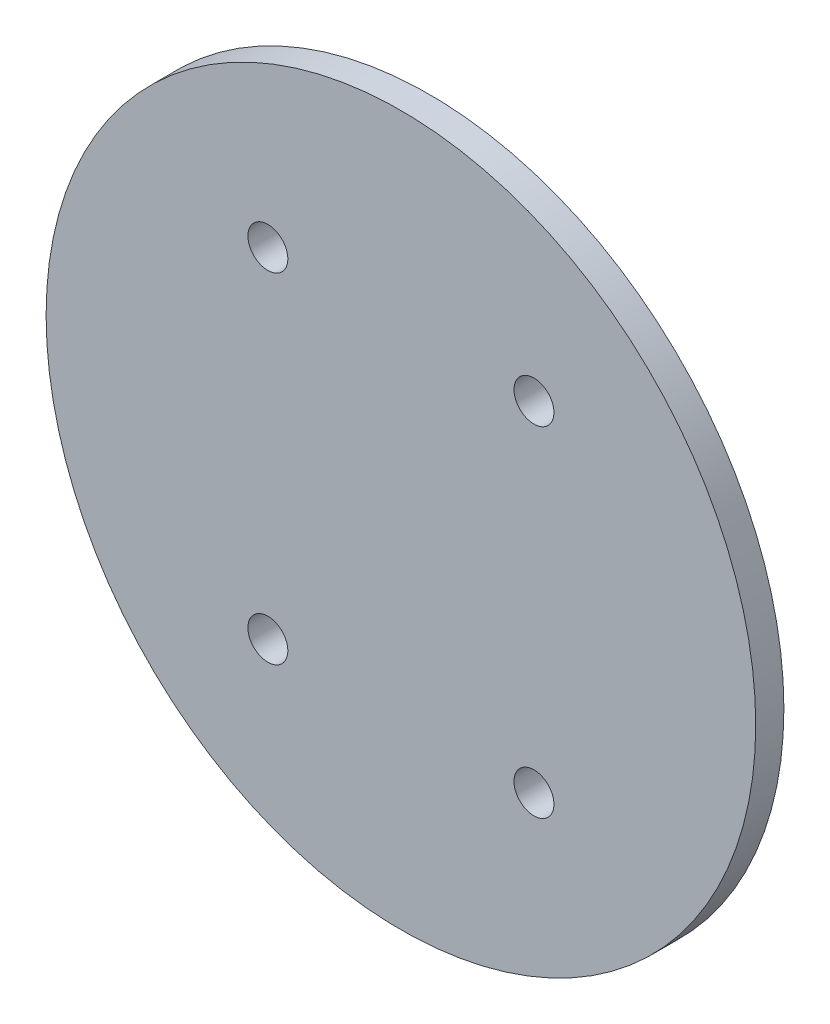
ISO-10303-21;
HEADER;
FILE_DESCRIPTION(('STEP AP214'),'2;1');
FILE_NAME('part.step','',(''),(''),'','','');
FILE_SCHEMA(('AUTOMOTIVE_DESIGN { 1 0 10303 214 1 1 1 1 }'));
ENDSEC;
DATA;
#1=APPLICATION_CONTEXT('core data for automotive mechanical design processes');
#2=APPLICATION_PROTOCOL_DEFINITION('international standard','automotive_design',2000,#1);
#3=PRODUCT_CONTEXT('',#1,'mechanical');
#4=PRODUCT('Part','Part','',(#3));
#5=PRODUCT_RELATED_PRODUCT_CATEGORY('part','',(#4));
#6=PRODUCT_DEFINITION_FORMATION('','',#4);
#7=PRODUCT_DEFINITION_CONTEXT('part definition',#1,'design');
#8=PRODUCT_DEFINITION('design','',#6,#7);
#9=PRODUCT_DEFINITION_SHAPE('','',#8);
#10=(LENGTH_UNIT() NAMED_UNIT(*) SI_UNIT(.MILLI.,.METRE.));
#11=(NAMED_UNIT(*) PLANE_ANGLE_UNIT() SI_UNIT($,.RADIAN.));
#12=(NAMED_UNIT(*) SI_UNIT($,.STERADIAN.) SOLID_ANGLE_UNIT());
#13=UNCERTAINTY_MEASURE_WITH_UNIT(LENGTH_MEASURE(1.E-05),#10,'distance_accuracy_value','');
#14=(GEOMETRIC_REPRESENTATION_CONTEXT(3) GLOBAL_UNCERTAINTY_ASSIGNED_CONTEXT((#13)) GLOBAL_UNIT_ASSIGNED_CONTEXT((#10,
#11,#12)) REPRESENTATION_CONTEXT('',''));
#15=CARTESIAN_POINT('',(0.,0.,0.));
#16=DIRECTION('',(0.,0.,1.));
#17=DIRECTION('',(1.,0.,0.));
#18=AXIS2_PLACEMENT_3D('',#15,#16,#17);
#19=CARTESIAN_POINT('',(0.,0.,-1.5875));
#20=DIRECTION('',(0.,0.,1.));
#21=DIRECTION('',(1.,0.,0.));
#22=AXIS2_PLACEMENT_3D('',#19,#20,#21);
#23=PLANE('',#22);
#24=CARTESIAN_POINT('',(-15.,19.125,-1.5875));
#25=DIRECTION('',(0.,0.,-1.));
#26=DIRECTION('',(-1.,0.,0.));
#27=AXIS2_PLACEMENT_3D('',#24,#25,#26);
#28=CIRCLE('',#27,2.24999999999999);
#29=CARTESIAN_POINT('',(-17.25,19.125,-1.5875));
#30=VERTEX_POINT('',#29);
#31=EDGE_CURVE('E72',#30,#30,#28,.T.);
#32=ORIENTED_EDGE('',*,*,#31,.F.);
#33=EDGE_LOOP('',(#32));
#34=FACE_BOUND('',#33,.T.);
#35=CARTESIAN_POINT('',(15.,19.125,-1.5875));
#36=DIRECTION('',(0.,0.,-1.));
#37=DIRECTION('',(-1.,0.,0.));
#38=AXIS2_PLACEMENT_3D('',#35,#36,#37);
#39=CIRCLE('',#38,2.24999999999999);
#40=CARTESIAN_POINT('',(12.75,19.125,-1.5875));
#41=VERTEX_POINT('',#40);
#42=EDGE_CURVE('E66',#41,#41,#39,.T.);
#43=ORIENTED_EDGE('',*,*,#42,.F.);
#44=EDGE_LOOP('',(#43));
#45=FACE_BOUND('',#44,.T.);
#46=CARTESIAN_POINT('',(15.,-19.125,-1.5875));
#47=DIRECTION('',(0.,0.,-1.));
#48=DIRECTION('',(-1.,0.,0.));
#49=AXIS2_PLACEMENT_3D('',#46,#47,#48);
#50=CIRCLE('',#49,2.24999999999999);
#51=CARTESIAN_POINT('',(12.75,-19.125,-1.5875));
#52=VERTEX_POINT('',#51);
#53=EDGE_CURVE('E60',#52,#52,#50,.T.);
#54=ORIENTED_EDGE('',*,*,#53,.F.);
#55=EDGE_LOOP('',(#54));
#56=FACE_BOUND('',#55,.T.);
#57=CARTESIAN_POINT('',(0.,0.,-1.5875));
#58=DIRECTION('',(0.,0.,1.));
#59=DIRECTION('',(1.,0.,0.));
#60=AXIS2_PLACEMENT_3D('',#57,#58,#59);
#61=CIRCLE('',#60,40.);
#62=CARTESIAN_POINT('',(40.,0.,-1.5875));
#63=VERTEX_POINT('',#62);
#64=EDGE_CURVE('E43',#63,#63,#61,.T.);
#65=ORIENTED_EDGE('',*,*,#64,.F.);
#66=EDGE_LOOP('',(#65));
#67=FACE_BOUND('',#66,.T.);
#68=CARTESIAN_POINT('',(-15.,-19.125,-1.5875));
#69=DIRECTION('',(0.,0.,-1.));
#70=DIRECTION('',(-1.,0.,0.));
#71=AXIS2_PLACEMENT_3D('',#68,#69,#70);
#72=CIRCLE('',#71,2.24999999999999);
#73=CARTESIAN_POINT('',(-17.25,-19.125,-1.5875));
#74=VERTEX_POINT('',#73);
#75=EDGE_CURVE('E54',#74,#74,#72,.T.);
#76=ORIENTED_EDGE('',*,*,#75,.F.);
#77=EDGE_LOOP('',(#76));
#78=FACE_BOUND('',#77,.T.);
#79=ADVANCED_FACE('F39',(#34,#45,#56,#67,#78),#23,.F.);
#80=CARTESIAN_POINT('',(0.,0.,1.5875));
#81=DIRECTION('',(0.,0.,-1.));
#82=DIRECTION('',(-1.,0.,0.));
#83=AXIS2_PLACEMENT_3D('',#80,#81,#82);
#84=CYLINDRICAL_SURFACE('',#83,40.);
#85=CARTESIAN_POINT('',(0.,0.,1.5875));
#86=DIRECTION('',(0.,0.,1.));
#87=DIRECTION('',(1.,0.,0.));
#88=AXIS2_PLACEMENT_3D('',#85,#86,#87);
#89=CIRCLE('',#88,40.);
#90=CARTESIAN_POINT('',(40.,0.,1.5875));
#91=VERTEX_POINT('',#90);
#92=EDGE_CURVE('E10',#91,#91,#89,.T.);
#93=ORIENTED_EDGE('',*,*,#92,.F.);
#94=EDGE_LOOP('',(#93));
#95=FACE_BOUND('',#94,.T.);
#96=ORIENTED_EDGE('',*,*,#64,.T.);
#97=EDGE_LOOP('',(#96));
#98=FACE_BOUND('',#97,.T.);
#99=ADVANCED_FACE('F41',(#95,#98),#84,.T.);
#100=CARTESIAN_POINT('',(0.,0.,1.5875));
#101=DIRECTION('',(0.,0.,1.));
#102=DIRECTION('',(1.,0.,0.));
#103=AXIS2_PLACEMENT_3D('',#100,#101,#102);
#104=PLANE('',#103);
#105=CARTESIAN_POINT('',(-15.,19.125,1.5875));
#106=DIRECTION('',(0.,0.,-1.));
#107=DIRECTION('',(-1.,0.,0.));
#108=AXIS2_PLACEMENT_3D('',#105,#106,#107);
#109=CIRCLE('',#108,2.25);
#110=CARTESIAN_POINT('',(-17.25,19.125,1.5875));
#111=VERTEX_POINT('',#110);
#112=EDGE_CURVE('E69',#111,#111,#109,.T.);
#113=ORIENTED_EDGE('',*,*,#112,.T.);
#114=EDGE_LOOP('',(#113));
#115=FACE_BOUND('',#114,.T.);
#116=CARTESIAN_POINT('',(15.,19.125,1.5875));
#117=DIRECTION('',(0.,0.,-1.));
#118=DIRECTION('',(-1.,0.,0.));
#119=AXIS2_PLACEMENT_3D('',#116,#117,#118);
#120=CIRCLE('',#119,2.25);
#121=CARTESIAN_POINT('',(12.75,19.125,1.5875));
#122=VERTEX_POINT('',#121);
#123=EDGE_CURVE('E63',#122,#122,#120,.T.);
#124=ORIENTED_EDGE('',*,*,#123,.T.);
#125=EDGE_LOOP('',(#124));
#126=FACE_BOUND('',#125,.T.);
#127=CARTESIAN_POINT('',(15.,-19.125,1.5875));
#128=DIRECTION('',(0.,0.,-1.));
#129=DIRECTION('',(-1.,0.,0.));
#130=AXIS2_PLACEMENT_3D('',#127,#128,#129);
#131=CIRCLE('',#130,2.25);
#132=CARTESIAN_POINT('',(12.75,-19.125,1.5875));
#133=VERTEX_POINT('',#132);
#134=EDGE_CURVE('E57',#133,#133,#131,.T.);
#135=ORIENTED_EDGE('',*,*,#134,.T.);
#136=EDGE_LOOP('',(#135));
#137=FACE_BOUND('',#136,.T.);
#138=CARTESIAN_POINT('',(-15.,-19.125,1.5875));
#139=DIRECTION('',(0.,0.,-1.));
#140=DIRECTION('',(-1.,0.,0.));
#141=AXIS2_PLACEMENT_3D('',#138,#139,#140);
#142=CIRCLE('',#141,2.25);
#143=CARTESIAN_POINT('',(-17.25,-19.125,1.5875));
#144=VERTEX_POINT('',#143);
#145=EDGE_CURVE('E50',#144,#144,#142,.T.);
#146=ORIENTED_EDGE('',*,*,#145,.T.);
#147=EDGE_LOOP('',(#146));
#148=FACE_BOUND('',#147,.T.);
#149=ORIENTED_EDGE('',*,*,#92,.T.);
#150=EDGE_LOOP('',(#149));
#151=FACE_BOUND('',#150,.T.);
#152=ADVANCED_FACE('F91',(#115,#126,#137,#148,#151),#104,.T.);
#153=CARTESIAN_POINT('',(-15.,-19.125,-1.5875));
#154=DIRECTION('',(0.,0.,-1.));
#155=DIRECTION('',(-1.,0.,0.));
#156=AXIS2_PLACEMENT_3D('',#153,#154,#155);
#157=CYLINDRICAL_SURFACE('',#156,2.24999999999999);
#158=ORIENTED_EDGE('',*,*,#145,.F.);
#159=EDGE_LOOP('',(#158));
#160=FACE_BOUND('',#159,.T.);
#161=ORIENTED_EDGE('',*,*,#75,.T.);
#162=EDGE_LOOP('',(#161));
#163=FACE_BOUND('',#162,.T.);
#164=ADVANCED_FACE('F88',(#160,#163),#157,.F.);
#165=CARTESIAN_POINT('',(15.,-19.125,-1.5875));
#166=DIRECTION('',(0.,0.,-1.));
#167=DIRECTION('',(-1.,0.,0.));
#168=AXIS2_PLACEMENT_3D('',#165,#166,#167);
#169=CYLINDRICAL_SURFACE('',#168,2.24999999999999);
#170=ORIENTED_EDGE('',*,*,#134,.F.);
#171=EDGE_LOOP('',(#170));
#172=FACE_BOUND('',#171,.T.);
#173=ORIENTED_EDGE('',*,*,#53,.T.);
#174=EDGE_LOOP('',(#173));
#175=FACE_BOUND('',#174,.T.);
#176=ADVANCED_FACE('F90',(#172,#175),#169,.F.);
#177=CARTESIAN_POINT('',(15.,19.125,-1.5875));
#178=DIRECTION('',(0.,0.,-1.));
#179=DIRECTION('',(-1.,0.,0.));
#180=AXIS2_PLACEMENT_3D('',#177,#178,#179);
#181=CYLINDRICAL_SURFACE('',#180,2.24999999999999);
#182=ORIENTED_EDGE('',*,*,#123,.F.);
#183=EDGE_LOOP('',(#182));
#184=FACE_BOUND('',#183,.T.);
#185=ORIENTED_EDGE('',*,*,#42,.T.);
#186=EDGE_LOOP('',(#185));
#187=FACE_BOUND('',#186,.T.);
#188=ADVANCED_FACE('F98',(#184,#187),#181,.F.);
#189=CARTESIAN_POINT('',(-15.,19.125,-1.5875));
#190=DIRECTION('',(0.,0.,-1.));
#191=DIRECTION('',(-1.,0.,0.));
#192=AXIS2_PLACEMENT_3D('',#189,#190,#191);
#193=CYLINDRICAL_SURFACE('',#192,2.24999999999999);
#194=ORIENTED_EDGE('',*,*,#112,.F.);
#195=EDGE_LOOP('',(#194));
#196=FACE_BOUND('',#195,.T.);
#197=ORIENTED_EDGE('',*,*,#31,.T.);
#198=EDGE_LOOP('',(#197));
#199=FACE_BOUND('',#198,.T.);
#200=ADVANCED_FACE('F76',(#196,#199),#193,.F.);
#201=CLOSED_SHELL('',(#79,#99,#152,#164,#176,#188,#200));
#202=MANIFOLD_SOLID_BREP('B2',#201);
#203=ADVANCED_BREP_SHAPE_REPRESENTATION('',(#18,#202),#14);
#204=SHAPE_DEFINITION_REPRESENTATION(#9,#203);
ENDSEC;
END-ISO-10303-21;
